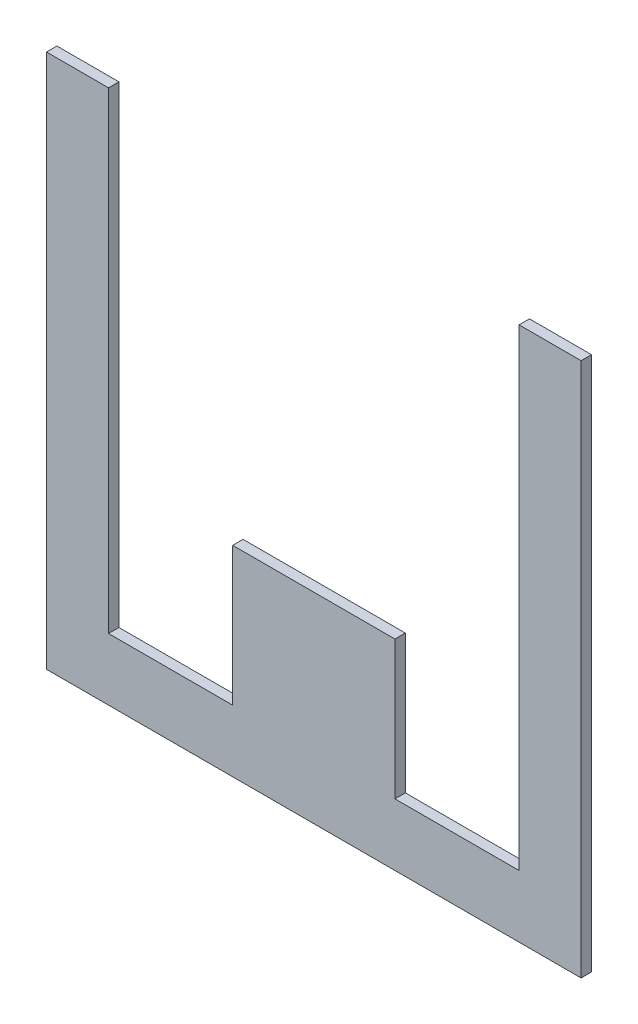
ISO-10303-21;
HEADER;
FILE_DESCRIPTION(('STEP AP214'),'2;1');
FILE_NAME('part.step','',(''),(''),'','','');
FILE_SCHEMA(('AUTOMOTIVE_DESIGN { 1 0 10303 214 1 1 1 1 }'));
ENDSEC;
DATA;
#1=APPLICATION_CONTEXT('core data for automotive mechanical design processes');
#2=APPLICATION_PROTOCOL_DEFINITION('international standard','automotive_design',2000,#1);
#3=PRODUCT_CONTEXT('',#1,'mechanical');
#4=PRODUCT('Part','Part','',(#3));
#5=PRODUCT_RELATED_PRODUCT_CATEGORY('part','',(#4));
#6=PRODUCT_DEFINITION_FORMATION('','',#4);
#7=PRODUCT_DEFINITION_CONTEXT('part definition',#1,'design');
#8=PRODUCT_DEFINITION('design','',#6,#7);
#9=PRODUCT_DEFINITION_SHAPE('','',#8);
#10=(LENGTH_UNIT() NAMED_UNIT(*) SI_UNIT(.MILLI.,.METRE.));
#11=(NAMED_UNIT(*) PLANE_ANGLE_UNIT() SI_UNIT($,.RADIAN.));
#12=(NAMED_UNIT(*) SI_UNIT($,.STERADIAN.) SOLID_ANGLE_UNIT());
#13=UNCERTAINTY_MEASURE_WITH_UNIT(LENGTH_MEASURE(1.E-05),#10,'distance_accuracy_value','');
#14=(GEOMETRIC_REPRESENTATION_CONTEXT(3) GLOBAL_UNCERTAINTY_ASSIGNED_CONTEXT((#13)) GLOBAL_UNIT_ASSIGNED_CONTEXT((#10,
#11,#12)) REPRESENTATION_CONTEXT('',''));
#15=CARTESIAN_POINT('',(0.,0.,0.));
#16=DIRECTION('',(0.,0.,1.));
#17=DIRECTION('',(1.,0.,0.));
#18=AXIS2_PLACEMENT_3D('',#15,#16,#17);
#19=CARTESIAN_POINT('',(-44.45,-44.45,1.7272));
#20=DIRECTION('',(1.,0.,0.));
#21=DIRECTION('',(0.,0.,-1.));
#22=AXIS2_PLACEMENT_3D('',#19,#20,#21);
#23=PLANE('',#22);
#24=DIRECTION('',(0.,-1.,0.));
#25=VECTOR('',#24,1.);
#26=CARTESIAN_POINT('',(-44.45,-44.45,0.));
#27=LINE('',#26,#25);
#28=CARTESIAN_POINT('',(-44.45,44.45,0.));
#29=VERTEX_POINT('',#28);
#30=CARTESIAN_POINT('',(-44.45,-44.45,0.));
#31=VERTEX_POINT('',#30);
#32=EDGE_CURVE('E452',#29,#31,#27,.T.);
#33=ORIENTED_EDGE('',*,*,#32,.T.);
#34=DIRECTION('',(0.,0.,-1.));
#35=VECTOR('',#34,1.);
#36=CARTESIAN_POINT('',(-44.45,-44.45,1.7272));
#37=LINE('',#36,#35);
#38=CARTESIAN_POINT('',(-44.45,-44.45,1.7272));
#39=VERTEX_POINT('',#38);
#40=EDGE_CURVE('E11',#39,#31,#37,.T.);
#41=ORIENTED_EDGE('',*,*,#40,.F.);
#42=DIRECTION('',(0.,-1.,0.));
#43=VECTOR('',#42,1.);
#44=CARTESIAN_POINT('',(-44.45,-44.45,1.7272));
#45=LINE('',#44,#43);
#46=CARTESIAN_POINT('',(-44.45,44.45,1.7272));
#47=VERTEX_POINT('',#46);
#48=EDGE_CURVE('E487',#47,#39,#45,.T.);
#49=ORIENTED_EDGE('',*,*,#48,.F.);
#50=DIRECTION('',(0.,0.,-1.));
#51=VECTOR('',#50,1.);
#52=CARTESIAN_POINT('',(-44.45,44.45,1.7272));
#53=LINE('',#52,#51);
#54=EDGE_CURVE('E465',#47,#29,#53,.T.);
#55=ORIENTED_EDGE('',*,*,#54,.T.);
#56=EDGE_LOOP('',(#33,#41,#49,#55));
#57=FACE_BOUND('',#56,.T.);
#58=ADVANCED_FACE('F360',(#57),#23,.F.);
#59=CARTESIAN_POINT('',(-44.45,-44.45,1.7272));
#60=DIRECTION('',(0.,1.,0.));
#61=DIRECTION('',(0.,0.,1.));
#62=AXIS2_PLACEMENT_3D('',#59,#60,#61);
#63=PLANE('',#62);
#64=DIRECTION('',(1.,0.,0.));
#65=VECTOR('',#64,1.);
#66=CARTESIAN_POINT('',(-44.45,-44.45,0.));
#67=LINE('',#66,#65);
#68=CARTESIAN_POINT('',(44.45,-44.45,0.));
#69=VERTEX_POINT('',#68);
#70=EDGE_CURVE('E448',#31,#69,#67,.T.);
#71=ORIENTED_EDGE('',*,*,#70,.T.);
#72=DIRECTION('',(0.,0.,-1.));
#73=VECTOR('',#72,1.);
#74=CARTESIAN_POINT('',(44.45,-44.45,1.7272));
#75=LINE('',#74,#73);
#76=CARTESIAN_POINT('',(44.45,-44.45,1.7272));
#77=VERTEX_POINT('',#76);
#78=EDGE_CURVE('E367',#77,#69,#75,.T.);
#79=ORIENTED_EDGE('',*,*,#78,.F.);
#80=DIRECTION('',(1.,0.,0.));
#81=VECTOR('',#80,1.);
#82=CARTESIAN_POINT('',(-44.45,-44.45,1.7272));
#83=LINE('',#82,#81);
#84=EDGE_CURVE('E461',#39,#77,#83,.T.);
#85=ORIENTED_EDGE('',*,*,#84,.F.);
#86=ORIENTED_EDGE('',*,*,#40,.T.);
#87=EDGE_LOOP('',(#71,#79,#85,#86));
#88=FACE_BOUND('',#87,.T.);
#89=ADVANCED_FACE('F460',(#88),#63,.F.);
#90=CARTESIAN_POINT('',(44.45,-44.45,1.7272));
#91=DIRECTION('',(-1.,0.,0.));
#92=DIRECTION('',(0.,0.,1.));
#93=AXIS2_PLACEMENT_3D('',#90,#91,#92);
#94=PLANE('',#93);
#95=DIRECTION('',(0.,1.,0.));
#96=VECTOR('',#95,1.);
#97=CARTESIAN_POINT('',(44.45,-44.45,0.));
#98=LINE('',#97,#96);
#99=CARTESIAN_POINT('',(44.45,44.45,0.));
#100=VERTEX_POINT('',#99);
#101=EDGE_CURVE('E454',#69,#100,#98,.T.);
#102=ORIENTED_EDGE('',*,*,#101,.T.);
#103=DIRECTION('',(0.,0.,-1.));
#104=VECTOR('',#103,1.);
#105=CARTESIAN_POINT('',(44.45,44.45,1.7272));
#106=LINE('',#105,#104);
#107=CARTESIAN_POINT('',(44.45,44.45,1.7272));
#108=VERTEX_POINT('',#107);
#109=EDGE_CURVE('E533',#108,#100,#106,.T.);
#110=ORIENTED_EDGE('',*,*,#109,.F.);
#111=DIRECTION('',(0.,1.,0.));
#112=VECTOR('',#111,1.);
#113=CARTESIAN_POINT('',(44.45,-44.45,1.7272));
#114=LINE('',#113,#112);
#115=EDGE_CURVE('E490',#77,#108,#114,.T.);
#116=ORIENTED_EDGE('',*,*,#115,.F.);
#117=ORIENTED_EDGE('',*,*,#78,.T.);
#118=EDGE_LOOP('',(#102,#110,#116,#117));
#119=FACE_BOUND('',#118,.T.);
#120=ADVANCED_FACE('F537',(#119),#94,.F.);
#121=CARTESIAN_POINT('',(34.13125,44.45,1.7272));
#122=DIRECTION('',(0.,-1.,0.));
#123=DIRECTION('',(1.,0.,0.));
#124=AXIS2_PLACEMENT_3D('',#121,#122,#123);
#125=PLANE('',#124);
#126=DIRECTION('',(-1.,0.,0.));
#127=VECTOR('',#126,1.);
#128=CARTESIAN_POINT('',(34.13125,44.45,0.));
#129=LINE('',#128,#127);
#130=CARTESIAN_POINT('',(34.13125,44.45,0.));
#131=VERTEX_POINT('',#130);
#132=EDGE_CURVE('E469',#100,#131,#129,.T.);
#133=ORIENTED_EDGE('',*,*,#132,.T.);
#134=DIRECTION('',(0.,0.,-1.));
#135=VECTOR('',#134,1.);
#136=CARTESIAN_POINT('',(34.13125,44.45,1.7272));
#137=LINE('',#136,#135);
#138=CARTESIAN_POINT('',(34.13125,44.45,1.7272));
#139=VERTEX_POINT('',#138);
#140=EDGE_CURVE('E530',#139,#131,#137,.T.);
#141=ORIENTED_EDGE('',*,*,#140,.F.);
#142=DIRECTION('',(-1.,0.,0.));
#143=VECTOR('',#142,1.);
#144=CARTESIAN_POINT('',(34.13125,44.45,1.7272));
#145=LINE('',#144,#143);
#146=EDGE_CURVE('E492',#108,#139,#145,.T.);
#147=ORIENTED_EDGE('',*,*,#146,.F.);
#148=ORIENTED_EDGE('',*,*,#109,.T.);
#149=EDGE_LOOP('',(#133,#141,#147,#148));
#150=FACE_BOUND('',#149,.T.);
#151=ADVANCED_FACE('F545',(#150),#125,.F.);
#152=CARTESIAN_POINT('',(34.13125,-34.12998,1.7272));
#153=DIRECTION('',(1.,0.,0.));
#154=DIRECTION('',(0.,1.,0.));
#155=AXIS2_PLACEMENT_3D('',#152,#153,#154);
#156=PLANE('',#155);
#157=DIRECTION('',(0.,-1.,0.));
#158=VECTOR('',#157,1.);
#159=CARTESIAN_POINT('',(34.13125,-34.12998,0.));
#160=LINE('',#159,#158);
#161=CARTESIAN_POINT('',(34.13125,-34.12998,0.));
#162=VERTEX_POINT('',#161);
#163=EDGE_CURVE('E471',#131,#162,#160,.T.);
#164=ORIENTED_EDGE('',*,*,#163,.T.);
#165=DIRECTION('',(0.,0.,-1.));
#166=VECTOR('',#165,1.);
#167=CARTESIAN_POINT('',(34.13125,-34.12998,1.7272));
#168=LINE('',#167,#166);
#169=CARTESIAN_POINT('',(34.13125,-34.12998,1.7272));
#170=VERTEX_POINT('',#169);
#171=EDGE_CURVE('E527',#170,#162,#168,.T.);
#172=ORIENTED_EDGE('',*,*,#171,.F.);
#173=DIRECTION('',(0.,-1.,0.));
#174=VECTOR('',#173,1.);
#175=CARTESIAN_POINT('',(34.13125,-34.12998,1.7272));
#176=LINE('',#175,#174);
#177=EDGE_CURVE('E494',#139,#170,#176,.T.);
#178=ORIENTED_EDGE('',*,*,#177,.F.);
#179=ORIENTED_EDGE('',*,*,#140,.T.);
#180=EDGE_LOOP('',(#164,#172,#178,#179));
#181=FACE_BOUND('',#180,.T.);
#182=ADVANCED_FACE('F548',(#181),#156,.F.);
#183=CARTESIAN_POINT('',(13.49375,-34.12998,1.7272));
#184=DIRECTION('',(0.,-1.,0.));
#185=DIRECTION('',(1.,0.,0.));
#186=AXIS2_PLACEMENT_3D('',#183,#184,#185);
#187=PLANE('',#186);
#188=DIRECTION('',(-1.,0.,0.));
#189=VECTOR('',#188,1.);
#190=CARTESIAN_POINT('',(13.49375,-34.12998,0.));
#191=LINE('',#190,#189);
#192=CARTESIAN_POINT('',(13.49375,-34.12998,0.));
#193=VERTEX_POINT('',#192);
#194=EDGE_CURVE('E473',#162,#193,#191,.T.);
#195=ORIENTED_EDGE('',*,*,#194,.T.);
#196=DIRECTION('',(0.,0.,-1.));
#197=VECTOR('',#196,1.);
#198=CARTESIAN_POINT('',(13.49375,-34.12998,1.7272));
#199=LINE('',#198,#197);
#200=CARTESIAN_POINT('',(13.49375,-34.12998,1.7272));
#201=VERTEX_POINT('',#200);
#202=EDGE_CURVE('E524',#201,#193,#199,.T.);
#203=ORIENTED_EDGE('',*,*,#202,.F.);
#204=DIRECTION('',(-1.,0.,0.));
#205=VECTOR('',#204,1.);
#206=CARTESIAN_POINT('',(13.49375,-34.12998,1.7272));
#207=LINE('',#206,#205);
#208=EDGE_CURVE('E496',#170,#201,#207,.T.);
#209=ORIENTED_EDGE('',*,*,#208,.F.);
#210=ORIENTED_EDGE('',*,*,#171,.T.);
#211=EDGE_LOOP('',(#195,#203,#209,#210));
#212=FACE_BOUND('',#211,.T.);
#213=ADVANCED_FACE('F553',(#212),#187,.F.);
#214=CARTESIAN_POINT('',(13.49375,-11.1125,1.7272));
#215=DIRECTION('',(-1.,0.,0.));
#216=DIRECTION('',(0.,-1.,0.));
#217=AXIS2_PLACEMENT_3D('',#214,#215,#216);
#218=PLANE('',#217);
#219=DIRECTION('',(0.,1.,0.));
#220=VECTOR('',#219,1.);
#221=CARTESIAN_POINT('',(13.49375,-11.1125,0.));
#222=LINE('',#221,#220);
#223=CARTESIAN_POINT('',(13.49375,-11.1125,0.));
#224=VERTEX_POINT('',#223);
#225=EDGE_CURVE('E475',#193,#224,#222,.T.);
#226=ORIENTED_EDGE('',*,*,#225,.T.);
#227=DIRECTION('',(0.,0.,-1.));
#228=VECTOR('',#227,1.);
#229=CARTESIAN_POINT('',(13.49375,-11.1125,1.7272));
#230=LINE('',#229,#228);
#231=CARTESIAN_POINT('',(13.49375,-11.1125,1.7272));
#232=VERTEX_POINT('',#231);
#233=EDGE_CURVE('E521',#232,#224,#230,.T.);
#234=ORIENTED_EDGE('',*,*,#233,.F.);
#235=DIRECTION('',(0.,1.,0.));
#236=VECTOR('',#235,1.);
#237=CARTESIAN_POINT('',(13.49375,-11.1125,1.7272));
#238=LINE('',#237,#236);
#239=EDGE_CURVE('E498',#201,#232,#238,.T.);
#240=ORIENTED_EDGE('',*,*,#239,.F.);
#241=ORIENTED_EDGE('',*,*,#202,.T.);
#242=EDGE_LOOP('',(#226,#234,#240,#241));
#243=FACE_BOUND('',#242,.T.);
#244=ADVANCED_FACE('F559',(#243),#218,.F.);
#245=CARTESIAN_POINT('',(-13.49375,-11.1125,1.7272));
#246=DIRECTION('',(0.,-1.,0.));
#247=DIRECTION('',(1.,0.,0.));
#248=AXIS2_PLACEMENT_3D('',#245,#246,#247);
#249=PLANE('',#248);
#250=DIRECTION('',(-1.,0.,0.));
#251=VECTOR('',#250,1.);
#252=CARTESIAN_POINT('',(-13.49375,-11.1125,0.));
#253=LINE('',#252,#251);
#254=CARTESIAN_POINT('',(-13.49375,-11.1125,0.));
#255=VERTEX_POINT('',#254);
#256=EDGE_CURVE('E477',#224,#255,#253,.T.);
#257=ORIENTED_EDGE('',*,*,#256,.T.);
#258=DIRECTION('',(0.,0.,-1.));
#259=VECTOR('',#258,1.);
#260=CARTESIAN_POINT('',(-13.49375,-11.1125,1.7272));
#261=LINE('',#260,#259);
#262=CARTESIAN_POINT('',(-13.49375,-11.1125,1.7272));
#263=VERTEX_POINT('',#262);
#264=EDGE_CURVE('E518',#263,#255,#261,.T.);
#265=ORIENTED_EDGE('',*,*,#264,.F.);
#266=DIRECTION('',(-1.,0.,0.));
#267=VECTOR('',#266,1.);
#268=CARTESIAN_POINT('',(-13.49375,-11.1125,1.7272));
#269=LINE('',#268,#267);
#270=EDGE_CURVE('E500',#232,#263,#269,.T.);
#271=ORIENTED_EDGE('',*,*,#270,.F.);
#272=ORIENTED_EDGE('',*,*,#233,.T.);
#273=EDGE_LOOP('',(#257,#265,#271,#272));
#274=FACE_BOUND('',#273,.T.);
#275=ADVANCED_FACE('F563',(#274),#249,.F.);
#276=CARTESIAN_POINT('',(-13.49375,-34.12998,1.7272));
#277=DIRECTION('',(1.,0.,0.));
#278=DIRECTION('',(0.,0.,-1.));
#279=AXIS2_PLACEMENT_3D('',#276,#277,#278);
#280=PLANE('',#279);
#281=DIRECTION('',(0.,-1.,0.));
#282=VECTOR('',#281,1.);
#283=CARTESIAN_POINT('',(-13.49375,-34.12998,0.));
#284=LINE('',#283,#282);
#285=CARTESIAN_POINT('',(-13.49375,-34.12998,0.));
#286=VERTEX_POINT('',#285);
#287=EDGE_CURVE('E479',#255,#286,#284,.T.);
#288=ORIENTED_EDGE('',*,*,#287,.T.);
#289=DIRECTION('',(0.,0.,-1.));
#290=VECTOR('',#289,1.);
#291=CARTESIAN_POINT('',(-13.49375,-34.12998,1.7272));
#292=LINE('',#291,#290);
#293=CARTESIAN_POINT('',(-13.49375,-34.12998,1.7272));
#294=VERTEX_POINT('',#293);
#295=EDGE_CURVE('E515',#294,#286,#292,.T.);
#296=ORIENTED_EDGE('',*,*,#295,.F.);
#297=DIRECTION('',(0.,-1.,0.));
#298=VECTOR('',#297,1.);
#299=CARTESIAN_POINT('',(-13.49375,-34.12998,1.7272));
#300=LINE('',#299,#298);
#301=EDGE_CURVE('E502',#263,#294,#300,.T.);
#302=ORIENTED_EDGE('',*,*,#301,.F.);
#303=ORIENTED_EDGE('',*,*,#264,.T.);
#304=EDGE_LOOP('',(#288,#296,#302,#303));
#305=FACE_BOUND('',#304,.T.);
#306=ADVANCED_FACE('F568',(#305),#280,.F.);
#307=CARTESIAN_POINT('',(-34.13125,-34.12998,1.7272));
#308=DIRECTION('',(0.,-1.,0.));
#309=DIRECTION('',(0.,0.,-1.));
#310=AXIS2_PLACEMENT_3D('',#307,#308,#309);
#311=PLANE('',#310);
#312=DIRECTION('',(-1.,0.,0.));
#313=VECTOR('',#312,1.);
#314=CARTESIAN_POINT('',(-34.13125,-34.12998,0.));
#315=LINE('',#314,#313);
#316=CARTESIAN_POINT('',(-34.13125,-34.12998,0.));
#317=VERTEX_POINT('',#316);
#318=EDGE_CURVE('E481',#286,#317,#315,.T.);
#319=ORIENTED_EDGE('',*,*,#318,.T.);
#320=DIRECTION('',(0.,0.,-1.));
#321=VECTOR('',#320,1.);
#322=CARTESIAN_POINT('',(-34.13125,-34.12998,1.7272));
#323=LINE('',#322,#321);
#324=CARTESIAN_POINT('',(-34.13125,-34.12998,1.7272));
#325=VERTEX_POINT('',#324);
#326=EDGE_CURVE('E512',#325,#317,#323,.T.);
#327=ORIENTED_EDGE('',*,*,#326,.F.);
#328=DIRECTION('',(-1.,0.,0.));
#329=VECTOR('',#328,1.);
#330=CARTESIAN_POINT('',(-34.13125,-34.12998,1.7272));
#331=LINE('',#330,#329);
#332=EDGE_CURVE('E504',#294,#325,#331,.T.);
#333=ORIENTED_EDGE('',*,*,#332,.F.);
#334=ORIENTED_EDGE('',*,*,#295,.T.);
#335=EDGE_LOOP('',(#319,#327,#333,#334));
#336=FACE_BOUND('',#335,.T.);
#337=ADVANCED_FACE('F572',(#336),#311,.F.);
#338=CARTESIAN_POINT('',(-34.13125,44.45,1.7272));
#339=DIRECTION('',(-1.,0.,0.));
#340=DIRECTION('',(0.,-1.,0.));
#341=AXIS2_PLACEMENT_3D('',#338,#339,#340);
#342=PLANE('',#341);
#343=DIRECTION('',(0.,1.,0.));
#344=VECTOR('',#343,1.);
#345=CARTESIAN_POINT('',(-34.13125,44.45,0.));
#346=LINE('',#345,#344);
#347=CARTESIAN_POINT('',(-34.13125,44.45,0.));
#348=VERTEX_POINT('',#347);
#349=EDGE_CURVE('E483',#317,#348,#346,.T.);
#350=ORIENTED_EDGE('',*,*,#349,.T.);
#351=DIRECTION('',(0.,0.,-1.));
#352=VECTOR('',#351,1.);
#353=CARTESIAN_POINT('',(-34.13125,44.45,1.7272));
#354=LINE('',#353,#352);
#355=CARTESIAN_POINT('',(-34.13125,44.45,1.7272));
#356=VERTEX_POINT('',#355);
#357=EDGE_CURVE('E509',#356,#348,#354,.T.);
#358=ORIENTED_EDGE('',*,*,#357,.F.);
#359=DIRECTION('',(0.,1.,0.));
#360=VECTOR('',#359,1.);
#361=CARTESIAN_POINT('',(-34.13125,44.45,1.7272));
#362=LINE('',#361,#360);
#363=EDGE_CURVE('E379',#325,#356,#362,.T.);
#364=ORIENTED_EDGE('',*,*,#363,.F.);
#365=ORIENTED_EDGE('',*,*,#326,.T.);
#366=EDGE_LOOP('',(#350,#358,#364,#365));
#367=FACE_BOUND('',#366,.T.);
#368=ADVANCED_FACE('F576',(#367),#342,.F.);
#369=CARTESIAN_POINT('',(-44.45,44.45,1.7272));
#370=DIRECTION('',(0.,-1.,0.));
#371=DIRECTION('',(0.,0.,-1.));
#372=AXIS2_PLACEMENT_3D('',#369,#370,#371);
#373=PLANE('',#372);
#374=DIRECTION('',(-1.,0.,0.));
#375=VECTOR('',#374,1.);
#376=CARTESIAN_POINT('',(-44.45,44.45,0.));
#377=LINE('',#376,#375);
#378=EDGE_CURVE('E485',#348,#29,#377,.T.);
#379=ORIENTED_EDGE('',*,*,#378,.T.);
#380=ORIENTED_EDGE('',*,*,#54,.F.);
#381=DIRECTION('',(-1.,0.,0.));
#382=VECTOR('',#381,1.);
#383=CARTESIAN_POINT('',(-44.45,44.45,1.7272));
#384=LINE('',#383,#382);
#385=EDGE_CURVE('E374',#356,#47,#384,.T.);
#386=ORIENTED_EDGE('',*,*,#385,.F.);
#387=ORIENTED_EDGE('',*,*,#357,.T.);
#388=EDGE_LOOP('',(#379,#380,#386,#387));
#389=FACE_BOUND('',#388,.T.);
#390=ADVANCED_FACE('F578',(#389),#373,.F.);
#391=CARTESIAN_POINT('',(-44.45,44.45,1.7272));
#392=DIRECTION('',(0.,0.,-1.));
#393=DIRECTION('',(-1.,0.,0.));
#394=AXIS2_PLACEMENT_3D('',#391,#392,#393);
#395=PLANE('',#394);
#396=ORIENTED_EDGE('',*,*,#48,.T.);
#397=ORIENTED_EDGE('',*,*,#84,.T.);
#398=ORIENTED_EDGE('',*,*,#115,.T.);
#399=ORIENTED_EDGE('',*,*,#146,.T.);
#400=ORIENTED_EDGE('',*,*,#177,.T.);
#401=ORIENTED_EDGE('',*,*,#208,.T.);
#402=ORIENTED_EDGE('',*,*,#239,.T.);
#403=ORIENTED_EDGE('',*,*,#270,.T.);
#404=ORIENTED_EDGE('',*,*,#301,.T.);
#405=ORIENTED_EDGE('',*,*,#332,.T.);
#406=ORIENTED_EDGE('',*,*,#363,.T.);
#407=ORIENTED_EDGE('',*,*,#385,.T.);
#408=EDGE_LOOP('',(#396,#397,#398,#399,#400,#401,#402,#403,#404,#405,#406,#407));
#409=FACE_BOUND('',#408,.T.);
#410=ADVANCED_FACE('F540',(#409),#395,.F.);
#411=CARTESIAN_POINT('',(-44.45,44.45,0.));
#412=DIRECTION('',(0.,0.,-1.));
#413=DIRECTION('',(-1.,0.,0.));
#414=AXIS2_PLACEMENT_3D('',#411,#412,#413);
#415=PLANE('',#414);
#416=ORIENTED_EDGE('',*,*,#32,.F.);
#417=ORIENTED_EDGE('',*,*,#378,.F.);
#418=ORIENTED_EDGE('',*,*,#349,.F.);
#419=ORIENTED_EDGE('',*,*,#318,.F.);
#420=ORIENTED_EDGE('',*,*,#287,.F.);
#421=ORIENTED_EDGE('',*,*,#256,.F.);
#422=ORIENTED_EDGE('',*,*,#225,.F.);
#423=ORIENTED_EDGE('',*,*,#194,.F.);
#424=ORIENTED_EDGE('',*,*,#163,.F.);
#425=ORIENTED_EDGE('',*,*,#132,.F.);
#426=ORIENTED_EDGE('',*,*,#101,.F.);
#427=ORIENTED_EDGE('',*,*,#70,.F.);
#428=EDGE_LOOP('',(#416,#417,#418,#419,#420,#421,#422,#423,#424,#425,#426,#427));
#429=FACE_BOUND('',#428,.T.);
#430=ADVANCED_FACE('F449',(#429),#415,.T.);
#431=CLOSED_SHELL('',(#58,#89,#120,#151,#182,#213,#244,#275,#306,#337,#368,#390,#410,#430));
#432=MANIFOLD_SOLID_BREP('B2',#431);
#433=ADVANCED_BREP_SHAPE_REPRESENTATION('',(#18,#432),#14);
#434=SHAPE_DEFINITION_REPRESENTATION(#9,#433);
ENDSEC;
END-ISO-10303-21;
